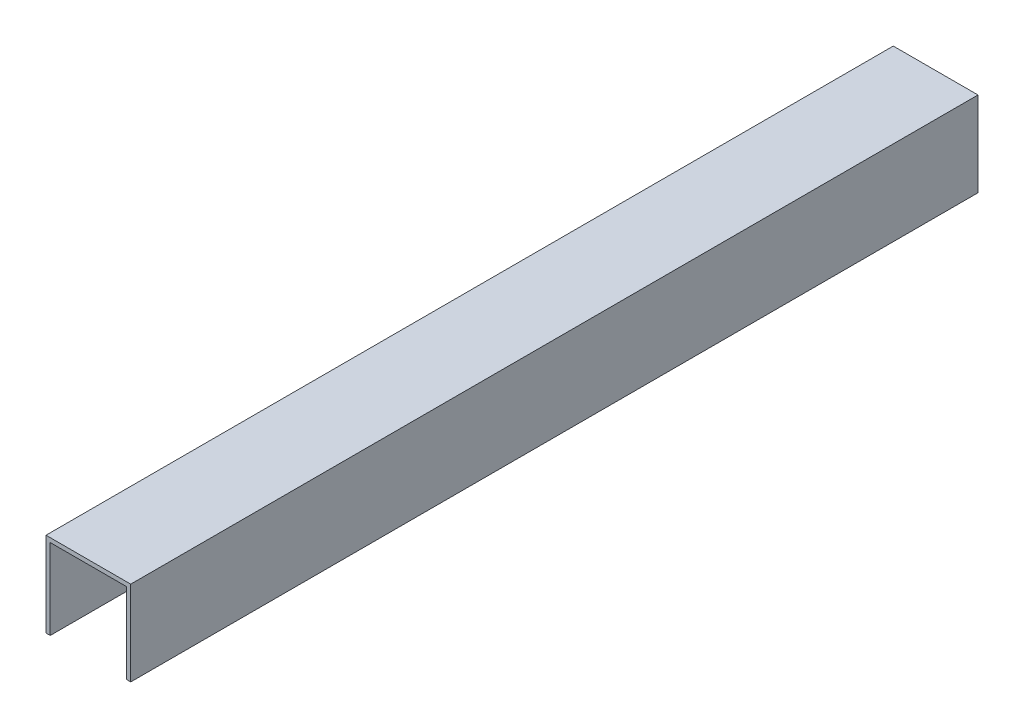
ISO-10303-21;
HEADER;
FILE_DESCRIPTION(('STEP AP214'),'2;1');
FILE_NAME('part.step','',(''),(''),'','','');
FILE_SCHEMA(('AUTOMOTIVE_DESIGN { 1 0 10303 214 1 1 1 1 }'));
ENDSEC;
DATA;
#1=APPLICATION_CONTEXT('core data for automotive mechanical design processes');
#2=APPLICATION_PROTOCOL_DEFINITION('international standard','automotive_design',2000,#1);
#3=PRODUCT_CONTEXT('',#1,'mechanical');
#4=PRODUCT('Part','Part','',(#3));
#5=PRODUCT_RELATED_PRODUCT_CATEGORY('part','',(#4));
#6=PRODUCT_DEFINITION_FORMATION('','',#4);
#7=PRODUCT_DEFINITION_CONTEXT('part definition',#1,'design');
#8=PRODUCT_DEFINITION('design','',#6,#7);
#9=PRODUCT_DEFINITION_SHAPE('','',#8);
#10=(LENGTH_UNIT() NAMED_UNIT(*) SI_UNIT(.MILLI.,.METRE.));
#11=(NAMED_UNIT(*) PLANE_ANGLE_UNIT() SI_UNIT($,.RADIAN.));
#12=(NAMED_UNIT(*) SI_UNIT($,.STERADIAN.) SOLID_ANGLE_UNIT());
#13=UNCERTAINTY_MEASURE_WITH_UNIT(LENGTH_MEASURE(1.E-05),#10,'distance_accuracy_value','');
#14=(GEOMETRIC_REPRESENTATION_CONTEXT(3) GLOBAL_UNCERTAINTY_ASSIGNED_CONTEXT((#13)) GLOBAL_UNIT_ASSIGNED_CONTEXT((#10,
#11,#12)) REPRESENTATION_CONTEXT('',''));
#15=CARTESIAN_POINT('',(0.,0.,0.));
#16=DIRECTION('',(0.,0.,1.));
#17=DIRECTION('',(1.,0.,0.));
#18=AXIS2_PLACEMENT_3D('',#15,#16,#17);
#19=CARTESIAN_POINT('',(-106.941493858928,-9.23320510783608,100.));
#20=DIRECTION('',(0.,1.,0.));
#21=DIRECTION('',(-1.,0.,0.));
#22=AXIS2_PLACEMENT_3D('',#19,#20,#21);
#23=PLANE('',#22);
#24=DIRECTION('',(1.,0.,0.));
#25=VECTOR('',#24,1.);
#26=CARTESIAN_POINT('',(-106.941493858928,-9.23320510783608,0.));
#27=LINE('',#26,#25);
#28=CARTESIAN_POINT('',(-107.441493858928,-9.23320510783608,0.));
#29=VERTEX_POINT('',#28);
#30=CARTESIAN_POINT('',(-106.941493858928,-9.23320510783608,0.));
#31=VERTEX_POINT('',#30);
#32=EDGE_CURVE('E128',#29,#31,#27,.T.);
#33=ORIENTED_EDGE('',*,*,#32,.T.);
#34=DIRECTION('',(0.,0.,-1.));
#35=VECTOR('',#34,1.);
#36=CARTESIAN_POINT('',(-106.941493858928,-9.23320510783608,100.));
#37=LINE('',#36,#35);
#38=CARTESIAN_POINT('',(-106.941493858928,-9.23320510783608,100.));
#39=VERTEX_POINT('',#38);
#40=EDGE_CURVE('E11',#39,#31,#37,.T.);
#41=ORIENTED_EDGE('',*,*,#40,.F.);
#42=DIRECTION('',(1.,0.,0.));
#43=VECTOR('',#42,1.);
#44=CARTESIAN_POINT('',(-106.941493858928,-9.23320510783608,100.));
#45=LINE('',#44,#43);
#46=CARTESIAN_POINT('',(-107.441493858928,-9.23320510783608,100.));
#47=VERTEX_POINT('',#46);
#48=EDGE_CURVE('E142',#47,#39,#45,.T.);
#49=ORIENTED_EDGE('',*,*,#48,.F.);
#50=DIRECTION('',(0.,0.,-1.));
#51=VECTOR('',#50,1.);
#52=CARTESIAN_POINT('',(-107.441493858928,-9.23320510783608,100.));
#53=LINE('',#52,#51);
#54=EDGE_CURVE('E124',#47,#29,#53,.T.);
#55=ORIENTED_EDGE('',*,*,#54,.T.);
#56=EDGE_LOOP('',(#33,#41,#49,#55));
#57=FACE_BOUND('',#56,.T.);
#58=ADVANCED_FACE('F32',(#57),#23,.F.);
#59=CARTESIAN_POINT('',(-106.941493858928,0.266794892163913,100.));
#60=DIRECTION('',(-1.,0.,0.));
#61=DIRECTION('',(0.,0.,1.));
#62=AXIS2_PLACEMENT_3D('',#59,#60,#61);
#63=PLANE('',#62);
#64=DIRECTION('',(0.,1.,0.));
#65=VECTOR('',#64,1.);
#66=CARTESIAN_POINT('',(-106.941493858928,0.266794892163913,0.));
#67=LINE('',#66,#65);
#68=CARTESIAN_POINT('',(-106.941493858928,0.266794892163913,0.));
#69=VERTEX_POINT('',#68);
#70=EDGE_CURVE('E131',#31,#69,#67,.T.);
#71=ORIENTED_EDGE('',*,*,#70,.T.);
#72=DIRECTION('',(0.,0.,-1.));
#73=VECTOR('',#72,1.);
#74=CARTESIAN_POINT('',(-106.941493858928,0.266794892163913,100.));
#75=LINE('',#74,#73);
#76=CARTESIAN_POINT('',(-106.941493858928,0.266794892163913,100.));
#77=VERTEX_POINT('',#76);
#78=EDGE_CURVE('E40',#77,#69,#75,.T.);
#79=ORIENTED_EDGE('',*,*,#78,.F.);
#80=DIRECTION('',(0.,1.,0.));
#81=VECTOR('',#80,1.);
#82=CARTESIAN_POINT('',(-106.941493858928,0.266794892163913,100.));
#83=LINE('',#82,#81);
#84=EDGE_CURVE('E91',#39,#77,#83,.T.);
#85=ORIENTED_EDGE('',*,*,#84,.F.);
#86=ORIENTED_EDGE('',*,*,#40,.T.);
#87=EDGE_LOOP('',(#71,#79,#85,#86));
#88=FACE_BOUND('',#87,.T.);
#89=ADVANCED_FACE('F177',(#88),#63,.F.);
#90=CARTESIAN_POINT('',(-97.9414938589285,0.266794892163915,100.));
#91=DIRECTION('',(0.,1.,0.));
#92=DIRECTION('',(-1.,0.,0.));
#93=AXIS2_PLACEMENT_3D('',#90,#91,#92);
#94=PLANE('',#93);
#95=DIRECTION('',(1.,0.,0.));
#96=VECTOR('',#95,1.);
#97=CARTESIAN_POINT('',(-97.9414938589285,0.266794892163915,0.));
#98=LINE('',#97,#96);
#99=CARTESIAN_POINT('',(-97.9414938589285,0.266794892163915,0.));
#100=VERTEX_POINT('',#99);
#101=EDGE_CURVE('E133',#69,#100,#98,.T.);
#102=ORIENTED_EDGE('',*,*,#101,.T.);
#103=DIRECTION('',(0.,0.,-1.));
#104=VECTOR('',#103,1.);
#105=CARTESIAN_POINT('',(-97.9414938589285,0.266794892163915,100.));
#106=LINE('',#105,#104);
#107=CARTESIAN_POINT('',(-97.9414938589285,0.266794892163915,100.));
#108=VERTEX_POINT('',#107);
#109=EDGE_CURVE('E149',#108,#100,#106,.T.);
#110=ORIENTED_EDGE('',*,*,#109,.F.);
#111=DIRECTION('',(1.,0.,0.));
#112=VECTOR('',#111,1.);
#113=CARTESIAN_POINT('',(-97.9414938589285,0.266794892163915,100.));
#114=LINE('',#113,#112);
#115=EDGE_CURVE('E157',#77,#108,#114,.T.);
#116=ORIENTED_EDGE('',*,*,#115,.F.);
#117=ORIENTED_EDGE('',*,*,#78,.T.);
#118=EDGE_LOOP('',(#102,#110,#116,#117));
#119=FACE_BOUND('',#118,.T.);
#120=ADVANCED_FACE('F155',(#119),#94,.F.);
#121=CARTESIAN_POINT('',(-97.9414938589285,-9.23320510783608,100.));
#122=DIRECTION('',(1.,0.,0.));
#123=DIRECTION('',(0.,0.,-1.));
#124=AXIS2_PLACEMENT_3D('',#121,#122,#123);
#125=PLANE('',#124);
#126=DIRECTION('',(0.,-1.,0.));
#127=VECTOR('',#126,1.);
#128=CARTESIAN_POINT('',(-97.9414938589285,-9.23320510783608,0.));
#129=LINE('',#128,#127);
#130=CARTESIAN_POINT('',(-97.9414938589285,-9.23320510783608,0.));
#131=VERTEX_POINT('',#130);
#132=EDGE_CURVE('E135',#100,#131,#129,.T.);
#133=ORIENTED_EDGE('',*,*,#132,.T.);
#134=DIRECTION('',(0.,0.,-1.));
#135=VECTOR('',#134,1.);
#136=CARTESIAN_POINT('',(-97.9414938589285,-9.23320510783608,100.));
#137=LINE('',#136,#135);
#138=CARTESIAN_POINT('',(-97.9414938589285,-9.23320510783608,100.));
#139=VERTEX_POINT('',#138);
#140=EDGE_CURVE('E146',#139,#131,#137,.T.);
#141=ORIENTED_EDGE('',*,*,#140,.F.);
#142=DIRECTION('',(0.,-1.,0.));
#143=VECTOR('',#142,1.);
#144=CARTESIAN_POINT('',(-97.9414938589285,-9.23320510783608,100.));
#145=LINE('',#144,#143);
#146=EDGE_CURVE('E169',#108,#139,#145,.T.);
#147=ORIENTED_EDGE('',*,*,#146,.F.);
#148=ORIENTED_EDGE('',*,*,#109,.T.);
#149=EDGE_LOOP('',(#133,#141,#147,#148));
#150=FACE_BOUND('',#149,.T.);
#151=ADVANCED_FACE('F165',(#150),#125,.F.);
#152=CARTESIAN_POINT('',(-97.4414938589285,-9.23320510783608,100.));
#153=DIRECTION('',(0.,1.,0.));
#154=DIRECTION('',(-1.,0.,0.));
#155=AXIS2_PLACEMENT_3D('',#152,#153,#154);
#156=PLANE('',#155);
#157=DIRECTION('',(1.,0.,0.));
#158=VECTOR('',#157,1.);
#159=CARTESIAN_POINT('',(-97.4414938589285,-9.23320510783608,0.));
#160=LINE('',#159,#158);
#161=CARTESIAN_POINT('',(-97.4414938589285,-9.23320510783608,0.));
#162=VERTEX_POINT('',#161);
#163=EDGE_CURVE('E137',#131,#162,#160,.T.);
#164=ORIENTED_EDGE('',*,*,#163,.T.);
#165=DIRECTION('',(0.,0.,-1.));
#166=VECTOR('',#165,1.);
#167=CARTESIAN_POINT('',(-97.4414938589285,-9.23320510783608,100.));
#168=LINE('',#167,#166);
#169=CARTESIAN_POINT('',(-97.4414938589285,-9.23320510783608,100.));
#170=VERTEX_POINT('',#169);
#171=EDGE_CURVE('E119',#170,#162,#168,.T.);
#172=ORIENTED_EDGE('',*,*,#171,.F.);
#173=DIRECTION('',(1.,0.,0.));
#174=VECTOR('',#173,1.);
#175=CARTESIAN_POINT('',(-97.4414938589285,-9.23320510783608,100.));
#176=LINE('',#175,#174);
#177=EDGE_CURVE('E110',#139,#170,#176,.T.);
#178=ORIENTED_EDGE('',*,*,#177,.F.);
#179=ORIENTED_EDGE('',*,*,#140,.T.);
#180=EDGE_LOOP('',(#164,#172,#178,#179));
#181=FACE_BOUND('',#180,.T.);
#182=ADVANCED_FACE('F168',(#181),#156,.F.);
#183=CARTESIAN_POINT('',(-97.4414938589285,0.766794892163917,100.));
#184=DIRECTION('',(-1.,0.,0.));
#185=DIRECTION('',(0.,0.,1.));
#186=AXIS2_PLACEMENT_3D('',#183,#184,#185);
#187=PLANE('',#186);
#188=DIRECTION('',(0.,1.,0.));
#189=VECTOR('',#188,1.);
#190=CARTESIAN_POINT('',(-97.4414938589285,0.766794892163917,0.));
#191=LINE('',#190,#189);
#192=CARTESIAN_POINT('',(-97.4414938589285,0.766794892163917,0.));
#193=VERTEX_POINT('',#192);
#194=EDGE_CURVE('E118',#162,#193,#191,.T.);
#195=ORIENTED_EDGE('',*,*,#194,.T.);
#196=DIRECTION('',(0.,0.,-1.));
#197=VECTOR('',#196,1.);
#198=CARTESIAN_POINT('',(-97.4414938589285,0.766794892163917,100.));
#199=LINE('',#198,#197);
#200=CARTESIAN_POINT('',(-97.4414938589285,0.766794892163917,100.));
#201=VERTEX_POINT('',#200);
#202=EDGE_CURVE('E115',#201,#193,#199,.T.);
#203=ORIENTED_EDGE('',*,*,#202,.F.);
#204=DIRECTION('',(0.,1.,0.));
#205=VECTOR('',#204,1.);
#206=CARTESIAN_POINT('',(-97.4414938589285,0.766794892163917,100.));
#207=LINE('',#206,#205);
#208=EDGE_CURVE('E104',#170,#201,#207,.T.);
#209=ORIENTED_EDGE('',*,*,#208,.F.);
#210=ORIENTED_EDGE('',*,*,#171,.T.);
#211=EDGE_LOOP('',(#195,#203,#209,#210));
#212=FACE_BOUND('',#211,.T.);
#213=ADVANCED_FACE('F116',(#212),#187,.F.);
#214=CARTESIAN_POINT('',(-107.441493858928,0.766794892163913,100.));
#215=DIRECTION('',(0.,-1.,0.));
#216=DIRECTION('',(1.,0.,0.));
#217=AXIS2_PLACEMENT_3D('',#214,#215,#216);
#218=PLANE('',#217);
#219=DIRECTION('',(-1.,0.,0.));
#220=VECTOR('',#219,1.);
#221=CARTESIAN_POINT('',(-107.441493858928,0.766794892163913,0.));
#222=LINE('',#221,#220);
#223=CARTESIAN_POINT('',(-107.441493858928,0.766794892163913,0.));
#224=VERTEX_POINT('',#223);
#225=EDGE_CURVE('E77',#193,#224,#222,.T.);
#226=ORIENTED_EDGE('',*,*,#225,.T.);
#227=DIRECTION('',(0.,0.,-1.));
#228=VECTOR('',#227,1.);
#229=CARTESIAN_POINT('',(-107.441493858928,0.766794892163913,100.));
#230=LINE('',#229,#228);
#231=CARTESIAN_POINT('',(-107.441493858928,0.766794892163913,100.));
#232=VERTEX_POINT('',#231);
#233=EDGE_CURVE('E120',#232,#224,#230,.T.);
#234=ORIENTED_EDGE('',*,*,#233,.F.);
#235=DIRECTION('',(-1.,0.,0.));
#236=VECTOR('',#235,1.);
#237=CARTESIAN_POINT('',(-107.441493858928,0.766794892163913,100.));
#238=LINE('',#237,#236);
#239=EDGE_CURVE('E108',#201,#232,#238,.T.);
#240=ORIENTED_EDGE('',*,*,#239,.F.);
#241=ORIENTED_EDGE('',*,*,#202,.T.);
#242=EDGE_LOOP('',(#226,#234,#240,#241));
#243=FACE_BOUND('',#242,.T.);
#244=ADVANCED_FACE('F122',(#243),#218,.F.);
#245=CARTESIAN_POINT('',(-107.441493858928,-9.23320510783608,100.));
#246=DIRECTION('',(1.,0.,0.));
#247=DIRECTION('',(0.,0.,-1.));
#248=AXIS2_PLACEMENT_3D('',#245,#246,#247);
#249=PLANE('',#248);
#250=DIRECTION('',(0.,-1.,0.));
#251=VECTOR('',#250,1.);
#252=CARTESIAN_POINT('',(-107.441493858928,-9.23320510783608,0.));
#253=LINE('',#252,#251);
#254=EDGE_CURVE('E83',#224,#29,#253,.T.);
#255=ORIENTED_EDGE('',*,*,#254,.T.);
#256=ORIENTED_EDGE('',*,*,#54,.F.);
#257=DIRECTION('',(0.,-1.,0.));
#258=VECTOR('',#257,1.);
#259=CARTESIAN_POINT('',(-107.441493858928,-9.23320510783608,100.));
#260=LINE('',#259,#258);
#261=EDGE_CURVE('E48',#232,#47,#260,.T.);
#262=ORIENTED_EDGE('',*,*,#261,.F.);
#263=ORIENTED_EDGE('',*,*,#233,.T.);
#264=EDGE_LOOP('',(#255,#256,#262,#263));
#265=FACE_BOUND('',#264,.T.);
#266=ADVANCED_FACE('F193',(#265),#249,.F.);
#267=CARTESIAN_POINT('',(0.,0.,100.));
#268=DIRECTION('',(0.,0.,-1.));
#269=DIRECTION('',(-1.,0.,0.));
#270=AXIS2_PLACEMENT_3D('',#267,#268,#269);
#271=PLANE('',#270);
#272=ORIENTED_EDGE('',*,*,#48,.T.);
#273=ORIENTED_EDGE('',*,*,#84,.T.);
#274=ORIENTED_EDGE('',*,*,#115,.T.);
#275=ORIENTED_EDGE('',*,*,#146,.T.);
#276=ORIENTED_EDGE('',*,*,#177,.T.);
#277=ORIENTED_EDGE('',*,*,#208,.T.);
#278=ORIENTED_EDGE('',*,*,#239,.T.);
#279=ORIENTED_EDGE('',*,*,#261,.T.);
#280=EDGE_LOOP('',(#272,#273,#274,#275,#276,#277,#278,#279));
#281=FACE_BOUND('',#280,.T.);
#282=ADVANCED_FACE('F106',(#281),#271,.F.);
#283=CARTESIAN_POINT('',(0.,0.,0.));
#284=DIRECTION('',(0.,0.,-1.));
#285=DIRECTION('',(-1.,0.,0.));
#286=AXIS2_PLACEMENT_3D('',#283,#284,#285);
#287=PLANE('',#286);
#288=ORIENTED_EDGE('',*,*,#32,.F.);
#289=ORIENTED_EDGE('',*,*,#254,.F.);
#290=ORIENTED_EDGE('',*,*,#225,.F.);
#291=ORIENTED_EDGE('',*,*,#194,.F.);
#292=ORIENTED_EDGE('',*,*,#163,.F.);
#293=ORIENTED_EDGE('',*,*,#132,.F.);
#294=ORIENTED_EDGE('',*,*,#101,.F.);
#295=ORIENTED_EDGE('',*,*,#70,.F.);
#296=EDGE_LOOP('',(#288,#289,#290,#291,#292,#293,#294,#295));
#297=FACE_BOUND('',#296,.T.);
#298=ADVANCED_FACE('F161',(#297),#287,.T.);
#299=CLOSED_SHELL('',(#58,#89,#120,#151,#182,#213,#244,#266,#282,#298));
#300=MANIFOLD_SOLID_BREP('B2',#299);
#301=ADVANCED_BREP_SHAPE_REPRESENTATION('',(#18,#300),#14);
#302=SHAPE_DEFINITION_REPRESENTATION(#9,#301);
ENDSEC;
END-ISO-10303-21;
